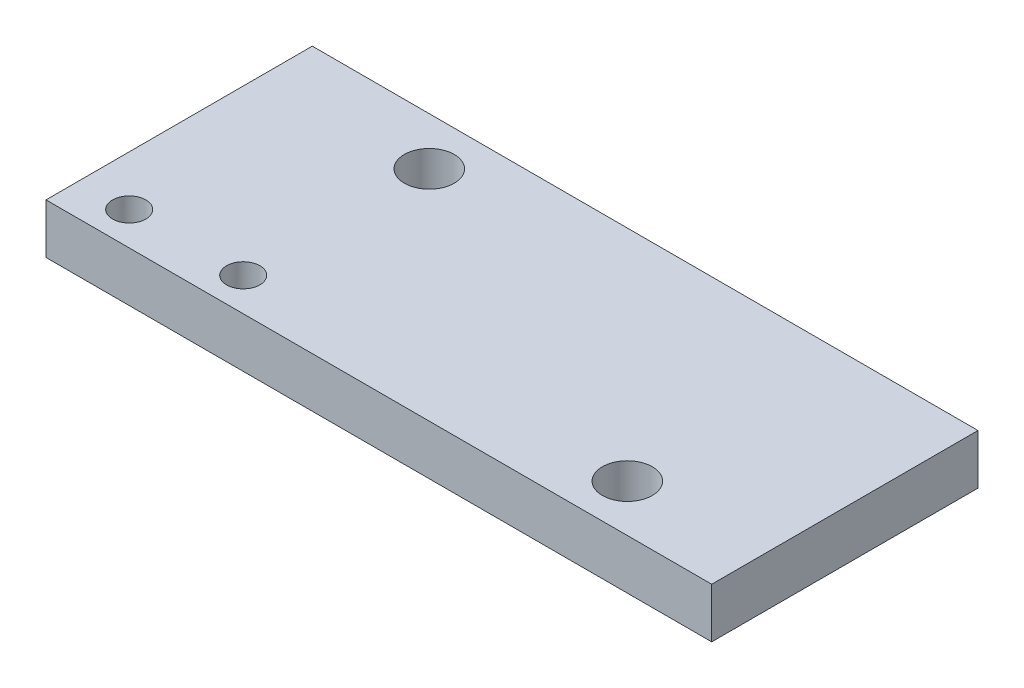
ISO-10303-21;
HEADER;
FILE_DESCRIPTION(('STEP AP214'),'2;1');
FILE_NAME('part.step','',(''),(''),'','','');
FILE_SCHEMA(('AUTOMOTIVE_DESIGN { 1 0 10303 214 1 1 1 1 }'));
ENDSEC;
DATA;
#1=APPLICATION_CONTEXT('core data for automotive mechanical design processes');
#2=APPLICATION_PROTOCOL_DEFINITION('international standard','automotive_design',2000,#1);
#3=PRODUCT_CONTEXT('',#1,'mechanical');
#4=PRODUCT('Part','Part','',(#3));
#5=PRODUCT_RELATED_PRODUCT_CATEGORY('part','',(#4));
#6=PRODUCT_DEFINITION_FORMATION('','',#4);
#7=PRODUCT_DEFINITION_CONTEXT('part definition',#1,'design');
#8=PRODUCT_DEFINITION('design','',#6,#7);
#9=PRODUCT_DEFINITION_SHAPE('','',#8);
#10=(LENGTH_UNIT() NAMED_UNIT(*) SI_UNIT(.MILLI.,.METRE.));
#11=(NAMED_UNIT(*) PLANE_ANGLE_UNIT() SI_UNIT($,.RADIAN.));
#12=(NAMED_UNIT(*) SI_UNIT($,.STERADIAN.) SOLID_ANGLE_UNIT());
#13=UNCERTAINTY_MEASURE_WITH_UNIT(LENGTH_MEASURE(1.E-05),#10,'distance_accuracy_value','');
#14=(GEOMETRIC_REPRESENTATION_CONTEXT(3) GLOBAL_UNCERTAINTY_ASSIGNED_CONTEXT((#13)) GLOBAL_UNIT_ASSIGNED_CONTEXT((#10,
#11,#12)) REPRESENTATION_CONTEXT('',''));
#15=CARTESIAN_POINT('',(0.,0.,0.));
#16=DIRECTION('',(0.,0.,1.));
#17=DIRECTION('',(1.,0.,0.));
#18=AXIS2_PLACEMENT_3D('',#15,#16,#17);
#19=CARTESIAN_POINT('',(0.,3.,0.));
#20=DIRECTION('',(0.,-1.,0.));
#21=DIRECTION('',(0.,0.,-1.));
#22=AXIS2_PLACEMENT_3D('',#19,#20,#21);
#23=PLANE('',#22);
#24=CARTESIAN_POINT('',(3.,3.,-2.));
#25=DIRECTION('',(0.,1.,0.));
#26=DIRECTION('',(0.,0.,1.));
#27=AXIS2_PLACEMENT_3D('',#24,#25,#26);
#28=CIRCLE('',#27,1.);
#29=CARTESIAN_POINT('',(3.,3.,-1.));
#30=VERTEX_POINT('',#29);
#31=EDGE_CURVE('E128',#30,#30,#28,.T.);
#32=ORIENTED_EDGE('',*,*,#31,.F.);
#33=EDGE_LOOP('',(#32));
#34=FACE_BOUND('',#33,.T.);
#35=CARTESIAN_POINT('',(9.85,3.,-2.));
#36=DIRECTION('',(0.,1.,0.));
#37=DIRECTION('',(0.,0.,1.));
#38=AXIS2_PLACEMENT_3D('',#35,#36,#37);
#39=CIRCLE('',#38,1.);
#40=CARTESIAN_POINT('',(9.85,3.,-1.));
#41=VERTEX_POINT('',#40);
#42=EDGE_CURVE('E136',#41,#41,#39,.T.);
#43=ORIENTED_EDGE('',*,*,#42,.F.);
#44=EDGE_LOOP('',(#43));
#45=FACE_BOUND('',#44,.T.);
#46=DIRECTION('',(0.,0.,1.));
#47=VECTOR('',#46,1.);
#48=CARTESIAN_POINT('',(0.,3.,0.));
#49=LINE('',#48,#47);
#50=CARTESIAN_POINT('',(0.,3.,-16.));
#51=VERTEX_POINT('',#50);
#52=CARTESIAN_POINT('',(0.,3.,0.));
#53=VERTEX_POINT('',#52);
#54=EDGE_CURVE('E94',#51,#53,#49,.T.);
#55=ORIENTED_EDGE('',*,*,#54,.T.);
#56=DIRECTION('',(1.,0.,0.));
#57=VECTOR('',#56,1.);
#58=CARTESIAN_POINT('',(0.,3.,0.));
#59=LINE('',#58,#57);
#60=CARTESIAN_POINT('',(40.,3.,0.));
#61=VERTEX_POINT('',#60);
#62=EDGE_CURVE('E89',#53,#61,#59,.T.);
#63=ORIENTED_EDGE('',*,*,#62,.T.);
#64=DIRECTION('',(0.,0.,-1.));
#65=VECTOR('',#64,1.);
#66=CARTESIAN_POINT('',(40.,3.,0.));
#67=LINE('',#66,#65);
#68=CARTESIAN_POINT('',(40.,3.,-16.));
#69=VERTEX_POINT('',#68);
#70=EDGE_CURVE('E92',#61,#69,#67,.T.);
#71=ORIENTED_EDGE('',*,*,#70,.T.);
#72=DIRECTION('',(-1.,0.,0.));
#73=VECTOR('',#72,1.);
#74=CARTESIAN_POINT('',(0.,3.,-16.));
#75=LINE('',#74,#73);
#76=EDGE_CURVE('E59',#69,#51,#75,.T.);
#77=ORIENTED_EDGE('',*,*,#76,.T.);
#78=EDGE_LOOP('',(#55,#63,#71,#77));
#79=FACE_BOUND('',#78,.T.);
#80=CARTESIAN_POINT('',(9.9,3.,-13.13));
#81=DIRECTION('',(0.,1.,0.));
#82=DIRECTION('',(0.,0.,1.));
#83=AXIS2_PLACEMENT_3D('',#80,#81,#82);
#84=CIRCLE('',#83,1.5);
#85=CARTESIAN_POINT('',(9.9,3.,-11.63));
#86=VERTEX_POINT('',#85);
#87=EDGE_CURVE('E115',#86,#86,#84,.T.);
#88=ORIENTED_EDGE('',*,*,#87,.F.);
#89=EDGE_LOOP('',(#88));
#90=FACE_BOUND('',#89,.T.);
#91=CARTESIAN_POINT('',(32.1,3.,-2.83));
#92=DIRECTION('',(0.,1.,0.));
#93=DIRECTION('',(0.,0.,1.));
#94=AXIS2_PLACEMENT_3D('',#91,#92,#93);
#95=CIRCLE('',#94,1.5);
#96=CARTESIAN_POINT('',(32.1,3.,-1.33));
#97=VERTEX_POINT('',#96);
#98=EDGE_CURVE('E144',#97,#97,#95,.T.);
#99=ORIENTED_EDGE('',*,*,#98,.F.);
#100=EDGE_LOOP('',(#99));
#101=FACE_BOUND('',#100,.T.);
#102=ADVANCED_FACE('F39',(#34,#45,#79,#90,#101),#23,.F.);
#103=CARTESIAN_POINT('',(0.,0.,0.));
#104=DIRECTION('',(0.,-1.,0.));
#105=DIRECTION('',(0.,0.,-1.));
#106=AXIS2_PLACEMENT_3D('',#103,#104,#105);
#107=PLANE('',#106);
#108=CARTESIAN_POINT('',(3.,0.,-2.));
#109=DIRECTION('',(0.,-1.,0.));
#110=DIRECTION('',(0.,0.,-1.));
#111=AXIS2_PLACEMENT_3D('',#108,#109,#110);
#112=CIRCLE('',#111,1.);
#113=CARTESIAN_POINT('',(3.,0.,-3.));
#114=VERTEX_POINT('',#113);
#115=EDGE_CURVE('E43',#114,#114,#112,.T.);
#116=ORIENTED_EDGE('',*,*,#115,.F.);
#117=EDGE_LOOP('',(#116));
#118=FACE_BOUND('',#117,.T.);
#119=CARTESIAN_POINT('',(9.85,0.,-2.));
#120=DIRECTION('',(0.,-1.,0.));
#121=DIRECTION('',(0.,0.,-1.));
#122=AXIS2_PLACEMENT_3D('',#119,#120,#121);
#123=CIRCLE('',#122,1.);
#124=CARTESIAN_POINT('',(9.85,0.,-3.));
#125=VERTEX_POINT('',#124);
#126=EDGE_CURVE('E125',#125,#125,#123,.T.);
#127=ORIENTED_EDGE('',*,*,#126,.F.);
#128=EDGE_LOOP('',(#127));
#129=FACE_BOUND('',#128,.T.);
#130=CARTESIAN_POINT('',(9.9,0.,-13.13));
#131=DIRECTION('',(0.,1.,0.));
#132=DIRECTION('',(0.,0.,1.));
#133=AXIS2_PLACEMENT_3D('',#130,#131,#132);
#134=CIRCLE('',#133,1.5);
#135=CARTESIAN_POINT('',(9.9,0.,-11.63));
#136=VERTEX_POINT('',#135);
#137=EDGE_CURVE('E148',#136,#136,#134,.T.);
#138=ORIENTED_EDGE('',*,*,#137,.T.);
#139=EDGE_LOOP('',(#138));
#140=FACE_BOUND('',#139,.T.);
#141=DIRECTION('',(0.,0.,1.));
#142=VECTOR('',#141,1.);
#143=CARTESIAN_POINT('',(0.,0.,0.));
#144=LINE('',#143,#142);
#145=CARTESIAN_POINT('',(0.,0.,-16.));
#146=VERTEX_POINT('',#145);
#147=CARTESIAN_POINT('',(0.,0.,0.));
#148=VERTEX_POINT('',#147);
#149=EDGE_CURVE('E111',#146,#148,#144,.T.);
#150=ORIENTED_EDGE('',*,*,#149,.F.);
#151=DIRECTION('',(-1.,0.,0.));
#152=VECTOR('',#151,1.);
#153=CARTESIAN_POINT('',(0.,0.,-16.));
#154=LINE('',#153,#152);
#155=CARTESIAN_POINT('',(40.,0.,-16.));
#156=VERTEX_POINT('',#155);
#157=EDGE_CURVE('E82',#156,#146,#154,.T.);
#158=ORIENTED_EDGE('',*,*,#157,.F.);
#159=DIRECTION('',(0.,0.,-1.));
#160=VECTOR('',#159,1.);
#161=CARTESIAN_POINT('',(40.,0.,0.));
#162=LINE('',#161,#160);
#163=CARTESIAN_POINT('',(40.,0.,0.));
#164=VERTEX_POINT('',#163);
#165=EDGE_CURVE('E76',#164,#156,#162,.T.);
#166=ORIENTED_EDGE('',*,*,#165,.F.);
#167=DIRECTION('',(1.,0.,0.));
#168=VECTOR('',#167,1.);
#169=CARTESIAN_POINT('',(0.,0.,0.));
#170=LINE('',#169,#168);
#171=EDGE_CURVE('E99',#148,#164,#170,.T.);
#172=ORIENTED_EDGE('',*,*,#171,.F.);
#173=EDGE_LOOP('',(#150,#158,#166,#172));
#174=FACE_BOUND('',#173,.T.);
#175=CARTESIAN_POINT('',(32.1,0.,-2.83));
#176=DIRECTION('',(0.,1.,0.));
#177=DIRECTION('',(0.,0.,1.));
#178=AXIS2_PLACEMENT_3D('',#175,#176,#177);
#179=CIRCLE('',#178,1.5);
#180=CARTESIAN_POINT('',(32.1,0.,-1.33));
#181=VERTEX_POINT('',#180);
#182=EDGE_CURVE('E134',#181,#181,#179,.T.);
#183=ORIENTED_EDGE('',*,*,#182,.T.);
#184=EDGE_LOOP('',(#183));
#185=FACE_BOUND('',#184,.T.);
#186=ADVANCED_FACE('F160',(#118,#129,#140,#174,#185),#107,.T.);
#187=CARTESIAN_POINT('',(0.,3.,0.));
#188=DIRECTION('',(1.,0.,0.));
#189=DIRECTION('',(0.,0.,-1.));
#190=AXIS2_PLACEMENT_3D('',#187,#188,#189);
#191=PLANE('',#190);
#192=ORIENTED_EDGE('',*,*,#149,.T.);
#193=DIRECTION('',(0.,-1.,0.));
#194=VECTOR('',#193,1.);
#195=CARTESIAN_POINT('',(0.,3.,0.));
#196=LINE('',#195,#194);
#197=EDGE_CURVE('E11',#53,#148,#196,.T.);
#198=ORIENTED_EDGE('',*,*,#197,.F.);
#199=ORIENTED_EDGE('',*,*,#54,.F.);
#200=DIRECTION('',(0.,-1.,0.));
#201=VECTOR('',#200,1.);
#202=CARTESIAN_POINT('',(0.,3.,-16.));
#203=LINE('',#202,#201);
#204=EDGE_CURVE('E107',#51,#146,#203,.T.);
#205=ORIENTED_EDGE('',*,*,#204,.T.);
#206=EDGE_LOOP('',(#192,#198,#199,#205));
#207=FACE_BOUND('',#206,.T.);
#208=ADVANCED_FACE('F41',(#207),#191,.F.);
#209=CARTESIAN_POINT('',(0.,3.,0.));
#210=DIRECTION('',(0.,0.,-1.));
#211=DIRECTION('',(-1.,0.,0.));
#212=AXIS2_PLACEMENT_3D('',#209,#210,#211);
#213=PLANE('',#212);
#214=ORIENTED_EDGE('',*,*,#171,.T.);
#215=DIRECTION('',(0.,-1.,0.));
#216=VECTOR('',#215,1.);
#217=CARTESIAN_POINT('',(40.,3.,0.));
#218=LINE('',#217,#216);
#219=EDGE_CURVE('E50',#61,#164,#218,.T.);
#220=ORIENTED_EDGE('',*,*,#219,.F.);
#221=ORIENTED_EDGE('',*,*,#62,.F.);
#222=ORIENTED_EDGE('',*,*,#197,.T.);
#223=EDGE_LOOP('',(#214,#220,#221,#222));
#224=FACE_BOUND('',#223,.T.);
#225=ADVANCED_FACE('F98',(#224),#213,.F.);
#226=CARTESIAN_POINT('',(40.,3.,0.));
#227=DIRECTION('',(-1.,0.,0.));
#228=DIRECTION('',(0.,0.,1.));
#229=AXIS2_PLACEMENT_3D('',#226,#227,#228);
#230=PLANE('',#229);
#231=ORIENTED_EDGE('',*,*,#165,.T.);
#232=DIRECTION('',(0.,-1.,0.));
#233=VECTOR('',#232,1.);
#234=CARTESIAN_POINT('',(40.,3.,-16.));
#235=LINE('',#234,#233);
#236=EDGE_CURVE('E101',#69,#156,#235,.T.);
#237=ORIENTED_EDGE('',*,*,#236,.F.);
#238=ORIENTED_EDGE('',*,*,#70,.F.);
#239=ORIENTED_EDGE('',*,*,#219,.T.);
#240=EDGE_LOOP('',(#231,#237,#238,#239));
#241=FACE_BOUND('',#240,.T.);
#242=ADVANCED_FACE('F103',(#241),#230,.F.);
#243=CARTESIAN_POINT('',(0.,3.,-16.));
#244=DIRECTION('',(0.,0.,1.));
#245=DIRECTION('',(1.,0.,0.));
#246=AXIS2_PLACEMENT_3D('',#243,#244,#245);
#247=PLANE('',#246);
#248=ORIENTED_EDGE('',*,*,#157,.T.);
#249=ORIENTED_EDGE('',*,*,#204,.F.);
#250=ORIENTED_EDGE('',*,*,#76,.F.);
#251=ORIENTED_EDGE('',*,*,#236,.T.);
#252=EDGE_LOOP('',(#248,#249,#250,#251));
#253=FACE_BOUND('',#252,.T.);
#254=ADVANCED_FACE('F166',(#253),#247,.F.);
#255=CARTESIAN_POINT('',(9.9,3.,-13.13));
#256=DIRECTION('',(0.,-1.,0.));
#257=DIRECTION('',(0.,0.,-1.));
#258=AXIS2_PLACEMENT_3D('',#255,#256,#257);
#259=CYLINDRICAL_SURFACE('',#258,1.5);
#260=ORIENTED_EDGE('',*,*,#87,.T.);
#261=EDGE_LOOP('',(#260));
#262=FACE_BOUND('',#261,.T.);
#263=ORIENTED_EDGE('',*,*,#137,.F.);
#264=EDGE_LOOP('',(#263));
#265=FACE_BOUND('',#264,.T.);
#266=ADVANCED_FACE('F163',(#262,#265),#259,.F.);
#267=CARTESIAN_POINT('',(32.1,3.,-2.83));
#268=DIRECTION('',(0.,-1.,0.));
#269=DIRECTION('',(0.,0.,-1.));
#270=AXIS2_PLACEMENT_3D('',#267,#268,#269);
#271=CYLINDRICAL_SURFACE('',#270,1.5);
#272=ORIENTED_EDGE('',*,*,#98,.T.);
#273=EDGE_LOOP('',(#272));
#274=FACE_BOUND('',#273,.T.);
#275=ORIENTED_EDGE('',*,*,#182,.F.);
#276=EDGE_LOOP('',(#275));
#277=FACE_BOUND('',#276,.T.);
#278=ADVANCED_FACE('F165',(#274,#277),#271,.F.);
#279=CARTESIAN_POINT('',(9.85,-7.,-2.));
#280=DIRECTION('',(0.,1.,0.));
#281=DIRECTION('',(0.,0.,1.));
#282=AXIS2_PLACEMENT_3D('',#279,#280,#281);
#283=CYLINDRICAL_SURFACE('',#282,1.);
#284=ORIENTED_EDGE('',*,*,#126,.T.);
#285=EDGE_LOOP('',(#284));
#286=FACE_BOUND('',#285,.T.);
#287=ORIENTED_EDGE('',*,*,#42,.T.);
#288=EDGE_LOOP('',(#287));
#289=FACE_BOUND('',#288,.T.);
#290=ADVANCED_FACE('F173',(#286,#289),#283,.F.);
#291=CARTESIAN_POINT('',(3.,-7.,-2.));
#292=DIRECTION('',(0.,1.,0.));
#293=DIRECTION('',(0.,0.,1.));
#294=AXIS2_PLACEMENT_3D('',#291,#292,#293);
#295=CYLINDRICAL_SURFACE('',#294,1.);
#296=ORIENTED_EDGE('',*,*,#115,.T.);
#297=EDGE_LOOP('',(#296));
#298=FACE_BOUND('',#297,.T.);
#299=ORIENTED_EDGE('',*,*,#31,.T.);
#300=EDGE_LOOP('',(#299));
#301=FACE_BOUND('',#300,.T.);
#302=ADVANCED_FACE('F215',(#298,#301),#295,.F.);
#303=CLOSED_SHELL('',(#102,#186,#208,#225,#242,#254,#266,#278,#290,#302));
#304=MANIFOLD_SOLID_BREP('B2',#303);
#305=ADVANCED_BREP_SHAPE_REPRESENTATION('',(#18,#304),#14);
#306=SHAPE_DEFINITION_REPRESENTATION(#9,#305);
ENDSEC;
END-ISO-10303-21;
